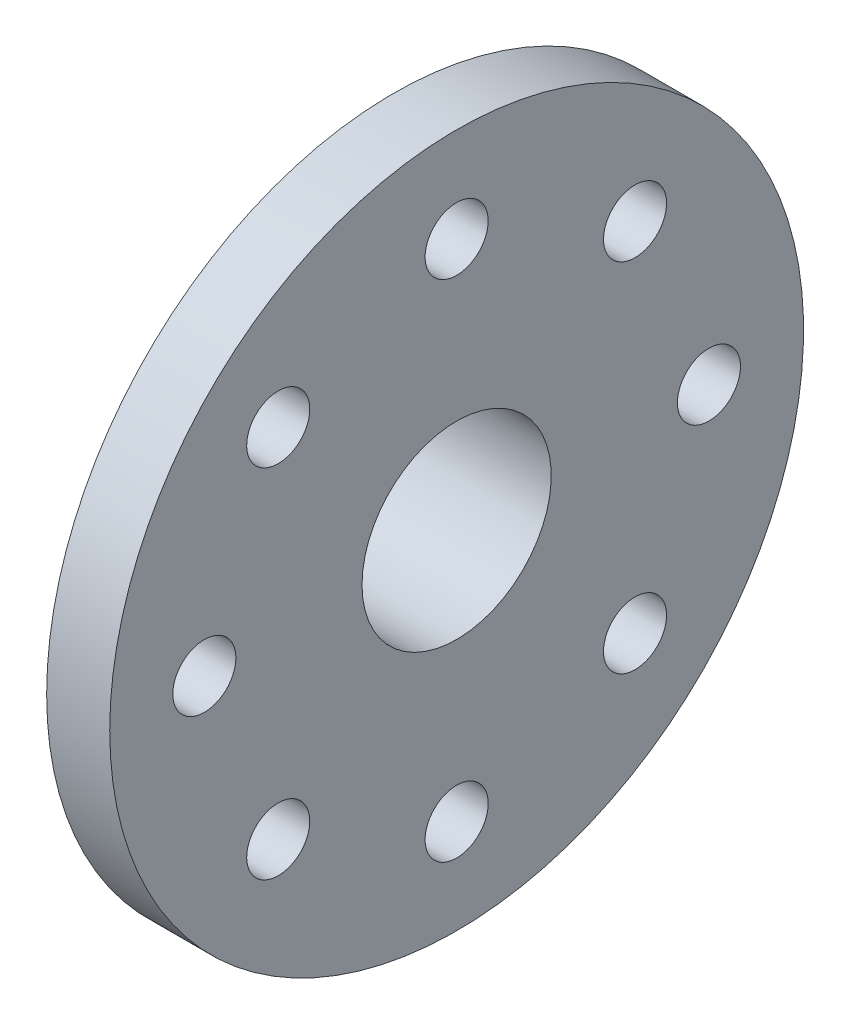
ISO-10303-21;
HEADER;
FILE_DESCRIPTION(('STEP AP214'),'2;1');
FILE_NAME('part.step','',(''),(''),'','','');
FILE_SCHEMA(('AUTOMOTIVE_DESIGN { 1 0 10303 214 1 1 1 1 }'));
ENDSEC;
DATA;
#1=APPLICATION_CONTEXT('core data for automotive mechanical design processes');
#2=APPLICATION_PROTOCOL_DEFINITION('international standard','automotive_design',2000,#1);
#3=PRODUCT_CONTEXT('',#1,'mechanical');
#4=PRODUCT('Part','Part','',(#3));
#5=PRODUCT_RELATED_PRODUCT_CATEGORY('part','',(#4));
#6=PRODUCT_DEFINITION_FORMATION('','',#4);
#7=PRODUCT_DEFINITION_CONTEXT('part definition',#1,'design');
#8=PRODUCT_DEFINITION('design','',#6,#7);
#9=PRODUCT_DEFINITION_SHAPE('','',#8);
#10=(LENGTH_UNIT() NAMED_UNIT(*) SI_UNIT(.MILLI.,.METRE.));
#11=(NAMED_UNIT(*) PLANE_ANGLE_UNIT() SI_UNIT($,.RADIAN.));
#12=(NAMED_UNIT(*) SI_UNIT($,.STERADIAN.) SOLID_ANGLE_UNIT());
#13=UNCERTAINTY_MEASURE_WITH_UNIT(LENGTH_MEASURE(1.E-05),#10,'distance_accuracy_value','');
#14=(GEOMETRIC_REPRESENTATION_CONTEXT(3) GLOBAL_UNCERTAINTY_ASSIGNED_CONTEXT((#13)) GLOBAL_UNIT_ASSIGNED_CONTEXT((#10,
#11,#12)) REPRESENTATION_CONTEXT('',''));
#15=CARTESIAN_POINT('',(0.,0.,0.));
#16=DIRECTION('',(0.,0.,1.));
#17=DIRECTION('',(1.,0.,0.));
#18=AXIS2_PLACEMENT_3D('',#15,#16,#17);
#19=CARTESIAN_POINT('',(1.,3.,0.));
#20=DIRECTION('',(-1.,0.,0.));
#21=DIRECTION('',(0.,0.,1.));
#22=AXIS2_PLACEMENT_3D('',#19,#20,#21);
#23=PLANE('',#22);
#24=CARTESIAN_POINT('',(1.,5.65685424949245,5.65685424949231));
#25=DIRECTION('',(-1.,0.,0.));
#26=DIRECTION('',(0.,-0.707106781186539,0.707106781186556));
#27=AXIS2_PLACEMENT_3D('',#24,#25,#26);
#28=CIRCLE('',#27,1.);
#29=CARTESIAN_POINT('',(1.,4.94974746830591,6.36396103067887));
#30=VERTEX_POINT('',#29);
#31=EDGE_CURVE('E86',#30,#30,#28,.T.);
#32=ORIENTED_EDGE('',*,*,#31,.T.);
#33=EDGE_LOOP('',(#32));
#34=FACE_BOUND('',#33,.T.);
#35=CARTESIAN_POINT('',(1.,0.,8.));
#36=DIRECTION('',(-1.,0.,0.));
#37=DIRECTION('',(0.,-1.,0.));
#38=AXIS2_PLACEMENT_3D('',#35,#36,#37);
#39=CIRCLE('',#38,1.);
#40=CARTESIAN_POINT('',(1.,-0.999999999999916,8.00000000000001));
#41=VERTEX_POINT('',#40);
#42=EDGE_CURVE('E80',#41,#41,#39,.T.);
#43=ORIENTED_EDGE('',*,*,#42,.T.);
#44=EDGE_LOOP('',(#43));
#45=FACE_BOUND('',#44,.T.);
#46=CARTESIAN_POINT('',(1.,-5.65685424949233,5.65685424949243));
#47=DIRECTION('',(-1.,0.,0.));
#48=DIRECTION('',(0.,-0.707106781186554,-0.707106781186541));
#49=AXIS2_PLACEMENT_3D('',#46,#47,#48);
#50=CIRCLE('',#49,1.);
#51=CARTESIAN_POINT('',(1.,-6.36396103067888,4.94974746830589));
#52=VERTEX_POINT('',#51);
#53=EDGE_CURVE('E74',#52,#52,#50,.T.);
#54=ORIENTED_EDGE('',*,*,#53,.T.);
#55=EDGE_LOOP('',(#54));
#56=FACE_BOUND('',#55,.T.);
#57=CARTESIAN_POINT('',(1.,-8.,0.));
#58=DIRECTION('',(-1.,0.,0.));
#59=DIRECTION('',(0.,0.,-1.));
#60=AXIS2_PLACEMENT_3D('',#57,#58,#59);
#61=CIRCLE('',#60,1.);
#62=CARTESIAN_POINT('',(1.,-8.,-1.));
#63=VERTEX_POINT('',#62);
#64=EDGE_CURVE('E68',#63,#63,#61,.T.);
#65=ORIENTED_EDGE('',*,*,#64,.T.);
#66=EDGE_LOOP('',(#65));
#67=FACE_BOUND('',#66,.T.);
#68=CARTESIAN_POINT('',(1.,-5.65685424949241,-5.65685424949235));
#69=DIRECTION('',(-1.,0.,0.));
#70=DIRECTION('',(0.,0.707106781186544,-0.707106781186551));
#71=AXIS2_PLACEMENT_3D('',#68,#69,#70);
#72=CIRCLE('',#71,1.);
#73=CARTESIAN_POINT('',(1.,-4.94974746830587,-6.3639610306789));
#74=VERTEX_POINT('',#73);
#75=EDGE_CURVE('E62',#74,#74,#72,.T.);
#76=ORIENTED_EDGE('',*,*,#75,.T.);
#77=EDGE_LOOP('',(#76));
#78=FACE_BOUND('',#77,.T.);
#79=CARTESIAN_POINT('',(1.,0.,-8.));
#80=DIRECTION('',(-1.,0.,0.));
#81=DIRECTION('',(0.,1.,0.));
#82=AXIS2_PLACEMENT_3D('',#79,#80,#81);
#83=CIRCLE('',#82,1.);
#84=CARTESIAN_POINT('',(1.,0.999999999999972,-8.));
#85=VERTEX_POINT('',#84);
#86=EDGE_CURVE('E56',#85,#85,#83,.T.);
#87=ORIENTED_EDGE('',*,*,#86,.T.);
#88=EDGE_LOOP('',(#87));
#89=FACE_BOUND('',#88,.T.);
#90=CARTESIAN_POINT('',(1.,5.65685424949237,-5.65685424949239));
#91=DIRECTION('',(-1.,0.,0.));
#92=DIRECTION('',(0.,0.707106781186549,0.707106781186546));
#93=AXIS2_PLACEMENT_3D('',#90,#91,#92);
#94=CIRCLE('',#93,1.);
#95=CARTESIAN_POINT('',(1.,6.36396103067892,-4.94974746830584));
#96=VERTEX_POINT('',#95);
#97=EDGE_CURVE('E50',#96,#96,#94,.T.);
#98=ORIENTED_EDGE('',*,*,#97,.T.);
#99=EDGE_LOOP('',(#98));
#100=FACE_BOUND('',#99,.T.);
#101=CARTESIAN_POINT('',(1.,8.,0.));
#102=DIRECTION('',(-1.,0.,0.));
#103=DIRECTION('',(0.,0.,1.));
#104=AXIS2_PLACEMENT_3D('',#101,#102,#103);
#105=CIRCLE('',#104,1.);
#106=CARTESIAN_POINT('',(1.,8.,1.));
#107=VERTEX_POINT('',#106);
#108=EDGE_CURVE('E46',#107,#107,#105,.T.);
#109=ORIENTED_EDGE('',*,*,#108,.T.);
#110=EDGE_LOOP('',(#109));
#111=FACE_BOUND('',#110,.T.);
#112=CARTESIAN_POINT('',(1.,0.,0.));
#113=DIRECTION('',(-1.,0.,0.));
#114=DIRECTION('',(0.,0.,1.));
#115=AXIS2_PLACEMENT_3D('',#112,#113,#114);
#116=CIRCLE('',#115,11.);
#117=CARTESIAN_POINT('',(1.,0.,11.));
#118=VERTEX_POINT('',#117);
#119=EDGE_CURVE('E10',#118,#118,#116,.T.);
#120=ORIENTED_EDGE('',*,*,#119,.F.);
#121=EDGE_LOOP('',(#120));
#122=FACE_BOUND('',#121,.T.);
#123=CARTESIAN_POINT('',(1.,0.,0.));
#124=DIRECTION('',(-1.,0.,0.));
#125=DIRECTION('',(0.,0.,1.));
#126=AXIS2_PLACEMENT_3D('',#123,#124,#125);
#127=CIRCLE('',#126,3.);
#128=CARTESIAN_POINT('',(1.,0.,3.));
#129=VERTEX_POINT('',#128);
#130=EDGE_CURVE('E43',#129,#129,#127,.T.);
#131=ORIENTED_EDGE('',*,*,#130,.T.);
#132=EDGE_LOOP('',(#131));
#133=FACE_BOUND('',#132,.T.);
#134=ADVANCED_FACE('F15',(#34,#45,#56,#67,#78,#89,#100,#111,#122,#133),#23,.F.);
#135=CARTESIAN_POINT('',(0.,0.,0.));
#136=DIRECTION('',(-1.,0.,0.));
#137=DIRECTION('',(0.,0.,1.));
#138=AXIS2_PLACEMENT_3D('',#135,#136,#137);
#139=CYLINDRICAL_SURFACE('',#138,11.);
#140=CARTESIAN_POINT('',(-1.,0.,0.));
#141=DIRECTION('',(-1.,0.,0.));
#142=DIRECTION('',(0.,0.,1.));
#143=AXIS2_PLACEMENT_3D('',#140,#141,#142);
#144=CIRCLE('',#143,11.);
#145=CARTESIAN_POINT('',(-1.,0.,11.));
#146=VERTEX_POINT('',#145);
#147=EDGE_CURVE('E21',#146,#146,#144,.T.);
#148=ORIENTED_EDGE('',*,*,#147,.F.);
#149=EDGE_LOOP('',(#148));
#150=FACE_BOUND('',#149,.T.);
#151=ORIENTED_EDGE('',*,*,#119,.T.);
#152=EDGE_LOOP('',(#151));
#153=FACE_BOUND('',#152,.T.);
#154=ADVANCED_FACE('F108',(#150,#153),#139,.T.);
#155=CARTESIAN_POINT('',(-1.,11.,0.));
#156=DIRECTION('',(1.,0.,0.));
#157=DIRECTION('',(0.,0.,-1.));
#158=AXIS2_PLACEMENT_3D('',#155,#156,#157);
#159=PLANE('',#158);
#160=CARTESIAN_POINT('',(-1.,5.65685424949245,5.65685424949231));
#161=DIRECTION('',(-1.,0.,0.));
#162=DIRECTION('',(0.,-0.707106781186539,0.707106781186556));
#163=AXIS2_PLACEMENT_3D('',#160,#161,#162);
#164=CIRCLE('',#163,1.);
#165=CARTESIAN_POINT('',(-1.,4.94974746830591,6.36396103067887));
#166=VERTEX_POINT('',#165);
#167=EDGE_CURVE('E89',#166,#166,#164,.T.);
#168=ORIENTED_EDGE('',*,*,#167,.F.);
#169=EDGE_LOOP('',(#168));
#170=FACE_BOUND('',#169,.T.);
#171=CARTESIAN_POINT('',(-1.,0.,8.));
#172=DIRECTION('',(-1.,0.,0.));
#173=DIRECTION('',(0.,-1.,0.));
#174=AXIS2_PLACEMENT_3D('',#171,#172,#173);
#175=CIRCLE('',#174,1.);
#176=CARTESIAN_POINT('',(-1.,-0.999999999999916,8.00000000000001));
#177=VERTEX_POINT('',#176);
#178=EDGE_CURVE('E83',#177,#177,#175,.T.);
#179=ORIENTED_EDGE('',*,*,#178,.F.);
#180=EDGE_LOOP('',(#179));
#181=FACE_BOUND('',#180,.T.);
#182=CARTESIAN_POINT('',(-1.,-5.65685424949233,5.65685424949243));
#183=DIRECTION('',(-1.,0.,0.));
#184=DIRECTION('',(0.,-0.707106781186554,-0.707106781186541));
#185=AXIS2_PLACEMENT_3D('',#182,#183,#184);
#186=CIRCLE('',#185,1.);
#187=CARTESIAN_POINT('',(-1.,-6.36396103067888,4.94974746830589));
#188=VERTEX_POINT('',#187);
#189=EDGE_CURVE('E77',#188,#188,#186,.T.);
#190=ORIENTED_EDGE('',*,*,#189,.F.);
#191=EDGE_LOOP('',(#190));
#192=FACE_BOUND('',#191,.T.);
#193=CARTESIAN_POINT('',(-1.,-8.,0.));
#194=DIRECTION('',(-1.,0.,0.));
#195=DIRECTION('',(0.,0.,-1.));
#196=AXIS2_PLACEMENT_3D('',#193,#194,#195);
#197=CIRCLE('',#196,1.);
#198=CARTESIAN_POINT('',(-1.,-8.,-1.));
#199=VERTEX_POINT('',#198);
#200=EDGE_CURVE('E71',#199,#199,#197,.T.);
#201=ORIENTED_EDGE('',*,*,#200,.F.);
#202=EDGE_LOOP('',(#201));
#203=FACE_BOUND('',#202,.T.);
#204=CARTESIAN_POINT('',(-1.,-5.65685424949241,-5.65685424949235));
#205=DIRECTION('',(-1.,0.,0.));
#206=DIRECTION('',(0.,0.707106781186544,-0.707106781186551));
#207=AXIS2_PLACEMENT_3D('',#204,#205,#206);
#208=CIRCLE('',#207,1.);
#209=CARTESIAN_POINT('',(-1.,-4.94974746830587,-6.3639610306789));
#210=VERTEX_POINT('',#209);
#211=EDGE_CURVE('E65',#210,#210,#208,.T.);
#212=ORIENTED_EDGE('',*,*,#211,.F.);
#213=EDGE_LOOP('',(#212));
#214=FACE_BOUND('',#213,.T.);
#215=CARTESIAN_POINT('',(-1.,0.,-8.));
#216=DIRECTION('',(-1.,0.,0.));
#217=DIRECTION('',(0.,1.,0.));
#218=AXIS2_PLACEMENT_3D('',#215,#216,#217);
#219=CIRCLE('',#218,1.);
#220=CARTESIAN_POINT('',(-1.,0.999999999999972,-8.));
#221=VERTEX_POINT('',#220);
#222=EDGE_CURVE('E59',#221,#221,#219,.T.);
#223=ORIENTED_EDGE('',*,*,#222,.F.);
#224=EDGE_LOOP('',(#223));
#225=FACE_BOUND('',#224,.T.);
#226=CARTESIAN_POINT('',(-1.,5.65685424949237,-5.65685424949239));
#227=DIRECTION('',(-1.,0.,0.));
#228=DIRECTION('',(0.,0.707106781186549,0.707106781186546));
#229=AXIS2_PLACEMENT_3D('',#226,#227,#228);
#230=CIRCLE('',#229,1.);
#231=CARTESIAN_POINT('',(-1.,6.36396103067892,-4.94974746830584));
#232=VERTEX_POINT('',#231);
#233=EDGE_CURVE('E53',#232,#232,#230,.T.);
#234=ORIENTED_EDGE('',*,*,#233,.F.);
#235=EDGE_LOOP('',(#234));
#236=FACE_BOUND('',#235,.T.);
#237=CARTESIAN_POINT('',(-1.,8.,0.));
#238=DIRECTION('',(-1.,0.,0.));
#239=DIRECTION('',(0.,0.,1.));
#240=AXIS2_PLACEMENT_3D('',#237,#238,#239);
#241=CIRCLE('',#240,1.);
#242=CARTESIAN_POINT('',(-1.,8.,1.));
#243=VERTEX_POINT('',#242);
#244=EDGE_CURVE('E47',#243,#243,#241,.T.);
#245=ORIENTED_EDGE('',*,*,#244,.F.);
#246=EDGE_LOOP('',(#245));
#247=FACE_BOUND('',#246,.T.);
#248=CARTESIAN_POINT('',(-1.,0.,0.));
#249=DIRECTION('',(-1.,0.,0.));
#250=DIRECTION('',(0.,0.,1.));
#251=AXIS2_PLACEMENT_3D('',#248,#249,#250);
#252=CIRCLE('',#251,3.75);
#253=CARTESIAN_POINT('',(-1.,0.,3.75));
#254=VERTEX_POINT('',#253);
#255=EDGE_CURVE('E25',#254,#254,#252,.T.);
#256=ORIENTED_EDGE('',*,*,#255,.F.);
#257=EDGE_LOOP('',(#256));
#258=FACE_BOUND('',#257,.T.);
#259=ORIENTED_EDGE('',*,*,#147,.T.);
#260=EDGE_LOOP('',(#259));
#261=FACE_BOUND('',#260,.T.);
#262=ADVANCED_FACE('F104',(#170,#181,#192,#203,#214,#225,#236,#247,#258,#261),#159,.F.);
#263=CARTESIAN_POINT('',(0.,0.,0.));
#264=DIRECTION('',(-1.,0.,0.));
#265=DIRECTION('',(0.,0.,1.));
#266=AXIS2_PLACEMENT_3D('',#263,#264,#265);
#267=CYLINDRICAL_SURFACE('',#266,3.75);
#268=CARTESIAN_POINT('',(-4.,0.,0.));
#269=DIRECTION('',(-1.,0.,0.));
#270=DIRECTION('',(0.,0.,1.));
#271=AXIS2_PLACEMENT_3D('',#268,#269,#270);
#272=CIRCLE('',#271,3.75);
#273=CARTESIAN_POINT('',(-4.,0.,3.75));
#274=VERTEX_POINT('',#273);
#275=EDGE_CURVE('E29',#274,#274,#272,.T.);
#276=ORIENTED_EDGE('',*,*,#275,.F.);
#277=EDGE_LOOP('',(#276));
#278=FACE_BOUND('',#277,.T.);
#279=ORIENTED_EDGE('',*,*,#255,.T.);
#280=EDGE_LOOP('',(#279));
#281=FACE_BOUND('',#280,.T.);
#282=ADVANCED_FACE('F107',(#278,#281),#267,.T.);
#283=CARTESIAN_POINT('',(-4.,3.75,0.));
#284=DIRECTION('',(1.,0.,0.));
#285=DIRECTION('',(0.,0.,-1.));
#286=AXIS2_PLACEMENT_3D('',#283,#284,#285);
#287=PLANE('',#286);
#288=CARTESIAN_POINT('',(-4.,0.,0.));
#289=DIRECTION('',(-1.,0.,0.));
#290=DIRECTION('',(0.,0.,1.));
#291=AXIS2_PLACEMENT_3D('',#288,#289,#290);
#292=CIRCLE('',#291,1.5);
#293=CARTESIAN_POINT('',(-4.,0.,1.5));
#294=VERTEX_POINT('',#293);
#295=EDGE_CURVE('E34',#294,#294,#292,.T.);
#296=ORIENTED_EDGE('',*,*,#295,.F.);
#297=EDGE_LOOP('',(#296));
#298=FACE_BOUND('',#297,.T.);
#299=ORIENTED_EDGE('',*,*,#275,.T.);
#300=EDGE_LOOP('',(#299));
#301=FACE_BOUND('',#300,.T.);
#302=ADVANCED_FACE('F127',(#298,#301),#287,.F.);
#303=CARTESIAN_POINT('',(0.,0.,0.));
#304=DIRECTION('',(-1.,0.,0.));
#305=DIRECTION('',(0.,0.,1.));
#306=AXIS2_PLACEMENT_3D('',#303,#304,#305);
#307=CYLINDRICAL_SURFACE('',#306,1.5);
#308=CARTESIAN_POINT('',(-3.5,0.,0.));
#309=DIRECTION('',(-1.,0.,0.));
#310=DIRECTION('',(0.,0.,1.));
#311=AXIS2_PLACEMENT_3D('',#308,#309,#310);
#312=CIRCLE('',#311,1.5);
#313=CARTESIAN_POINT('',(-3.5,0.,1.5));
#314=VERTEX_POINT('',#313);
#315=EDGE_CURVE('E37',#314,#314,#312,.T.);
#316=ORIENTED_EDGE('',*,*,#315,.F.);
#317=EDGE_LOOP('',(#316));
#318=FACE_BOUND('',#317,.T.);
#319=ORIENTED_EDGE('',*,*,#295,.T.);
#320=EDGE_LOOP('',(#319));
#321=FACE_BOUND('',#320,.T.);
#322=ADVANCED_FACE('F134',(#318,#321),#307,.F.);
#323=CARTESIAN_POINT('',(-3.5,3.,0.));
#324=DIRECTION('',(-1.,0.,0.));
#325=DIRECTION('',(0.,0.,1.));
#326=AXIS2_PLACEMENT_3D('',#323,#324,#325);
#327=PLANE('',#326);
#328=CARTESIAN_POINT('',(-3.5,0.,0.));
#329=DIRECTION('',(-1.,0.,0.));
#330=DIRECTION('',(0.,0.,1.));
#331=AXIS2_PLACEMENT_3D('',#328,#329,#330);
#332=CIRCLE('',#331,3.);
#333=CARTESIAN_POINT('',(-3.5,0.,3.));
#334=VERTEX_POINT('',#333);
#335=EDGE_CURVE('E40',#334,#334,#332,.T.);
#336=ORIENTED_EDGE('',*,*,#335,.F.);
#337=EDGE_LOOP('',(#336));
#338=FACE_BOUND('',#337,.T.);
#339=ORIENTED_EDGE('',*,*,#315,.T.);
#340=EDGE_LOOP('',(#339));
#341=FACE_BOUND('',#340,.T.);
#342=ADVANCED_FACE('F176',(#338,#341),#327,.F.);
#343=CARTESIAN_POINT('',(0.,0.,0.));
#344=DIRECTION('',(-1.,0.,0.));
#345=DIRECTION('',(0.,0.,1.));
#346=AXIS2_PLACEMENT_3D('',#343,#344,#345);
#347=CYLINDRICAL_SURFACE('',#346,3.);
#348=ORIENTED_EDGE('',*,*,#130,.F.);
#349=EDGE_LOOP('',(#348));
#350=FACE_BOUND('',#349,.T.);
#351=ORIENTED_EDGE('',*,*,#335,.T.);
#352=EDGE_LOOP('',(#351));
#353=FACE_BOUND('',#352,.T.);
#354=ADVANCED_FACE('F187',(#350,#353),#347,.F.);
#355=CARTESIAN_POINT('',(1.,8.,0.));
#356=DIRECTION('',(-1.,0.,0.));
#357=DIRECTION('',(0.,0.,1.));
#358=AXIS2_PLACEMENT_3D('',#355,#356,#357);
#359=CYLINDRICAL_SURFACE('',#358,1.);
#360=ORIENTED_EDGE('',*,*,#108,.F.);
#361=EDGE_LOOP('',(#360));
#362=FACE_BOUND('',#361,.T.);
#363=ORIENTED_EDGE('',*,*,#244,.T.);
#364=EDGE_LOOP('',(#363));
#365=FACE_BOUND('',#364,.T.);
#366=ADVANCED_FACE('F198',(#362,#365),#359,.F.);
#367=CARTESIAN_POINT('',(1.,5.65685424949237,-5.65685424949239));
#368=DIRECTION('',(-1.,0.,0.));
#369=DIRECTION('',(0.,0.,1.));
#370=AXIS2_PLACEMENT_3D('',#367,#368,#369);
#371=CYLINDRICAL_SURFACE('',#370,1.);
#372=ORIENTED_EDGE('',*,*,#97,.F.);
#373=EDGE_LOOP('',(#372));
#374=FACE_BOUND('',#373,.T.);
#375=ORIENTED_EDGE('',*,*,#233,.T.);
#376=EDGE_LOOP('',(#375));
#377=FACE_BOUND('',#376,.T.);
#378=ADVANCED_FACE('F209',(#374,#377),#371,.F.);
#379=CARTESIAN_POINT('',(1.,0.,-8.));
#380=DIRECTION('',(-1.,0.,0.));
#381=DIRECTION('',(0.,0.,1.));
#382=AXIS2_PLACEMENT_3D('',#379,#380,#381);
#383=CYLINDRICAL_SURFACE('',#382,1.);
#384=ORIENTED_EDGE('',*,*,#86,.F.);
#385=EDGE_LOOP('',(#384));
#386=FACE_BOUND('',#385,.T.);
#387=ORIENTED_EDGE('',*,*,#222,.T.);
#388=EDGE_LOOP('',(#387));
#389=FACE_BOUND('',#388,.T.);
#390=ADVANCED_FACE('F220',(#386,#389),#383,.F.);
#391=CARTESIAN_POINT('',(1.,-5.65685424949241,-5.65685424949235));
#392=DIRECTION('',(-1.,0.,0.));
#393=DIRECTION('',(0.,0.,1.));
#394=AXIS2_PLACEMENT_3D('',#391,#392,#393);
#395=CYLINDRICAL_SURFACE('',#394,1.);
#396=ORIENTED_EDGE('',*,*,#75,.F.);
#397=EDGE_LOOP('',(#396));
#398=FACE_BOUND('',#397,.T.);
#399=ORIENTED_EDGE('',*,*,#211,.T.);
#400=EDGE_LOOP('',(#399));
#401=FACE_BOUND('',#400,.T.);
#402=ADVANCED_FACE('F231',(#398,#401),#395,.F.);
#403=CARTESIAN_POINT('',(1.,-8.,0.));
#404=DIRECTION('',(-1.,0.,0.));
#405=DIRECTION('',(0.,0.,1.));
#406=AXIS2_PLACEMENT_3D('',#403,#404,#405);
#407=CYLINDRICAL_SURFACE('',#406,1.);
#408=ORIENTED_EDGE('',*,*,#64,.F.);
#409=EDGE_LOOP('',(#408));
#410=FACE_BOUND('',#409,.T.);
#411=ORIENTED_EDGE('',*,*,#200,.T.);
#412=EDGE_LOOP('',(#411));
#413=FACE_BOUND('',#412,.T.);
#414=ADVANCED_FACE('F242',(#410,#413),#407,.F.);
#415=CARTESIAN_POINT('',(1.,-5.65685424949233,5.65685424949243));
#416=DIRECTION('',(-1.,0.,0.));
#417=DIRECTION('',(0.,0.,1.));
#418=AXIS2_PLACEMENT_3D('',#415,#416,#417);
#419=CYLINDRICAL_SURFACE('',#418,1.);
#420=ORIENTED_EDGE('',*,*,#53,.F.);
#421=EDGE_LOOP('',(#420));
#422=FACE_BOUND('',#421,.T.);
#423=ORIENTED_EDGE('',*,*,#189,.T.);
#424=EDGE_LOOP('',(#423));
#425=FACE_BOUND('',#424,.T.);
#426=ADVANCED_FACE('F253',(#422,#425),#419,.F.);
#427=CARTESIAN_POINT('',(1.,0.,8.));
#428=DIRECTION('',(-1.,0.,0.));
#429=DIRECTION('',(0.,0.,1.));
#430=AXIS2_PLACEMENT_3D('',#427,#428,#429);
#431=CYLINDRICAL_SURFACE('',#430,1.);
#432=ORIENTED_EDGE('',*,*,#42,.F.);
#433=EDGE_LOOP('',(#432));
#434=FACE_BOUND('',#433,.T.);
#435=ORIENTED_EDGE('',*,*,#178,.T.);
#436=EDGE_LOOP('',(#435));
#437=FACE_BOUND('',#436,.T.);
#438=ADVANCED_FACE('F100',(#434,#437),#431,.F.);
#439=CARTESIAN_POINT('',(1.,5.65685424949245,5.65685424949231));
#440=DIRECTION('',(-1.,0.,0.));
#441=DIRECTION('',(0.,0.,1.));
#442=AXIS2_PLACEMENT_3D('',#439,#440,#441);
#443=CYLINDRICAL_SURFACE('',#442,1.);
#444=ORIENTED_EDGE('',*,*,#31,.F.);
#445=EDGE_LOOP('',(#444));
#446=FACE_BOUND('',#445,.T.);
#447=ORIENTED_EDGE('',*,*,#167,.T.);
#448=EDGE_LOOP('',(#447));
#449=FACE_BOUND('',#448,.T.);
#450=ADVANCED_FACE('F97',(#446,#449),#443,.F.);
#451=CLOSED_SHELL('',(#134,#154,#262,#282,#302,#322,#342,#354,#366,#378,#390,#402,#414,#426,
#438,#450));
#452=MANIFOLD_SOLID_BREP('B1',#451);
#453=ADVANCED_BREP_SHAPE_REPRESENTATION('',(#18,#452),#14);
#454=SHAPE_DEFINITION_REPRESENTATION(#9,#453);
ENDSEC;
END-ISO-10303-21;
